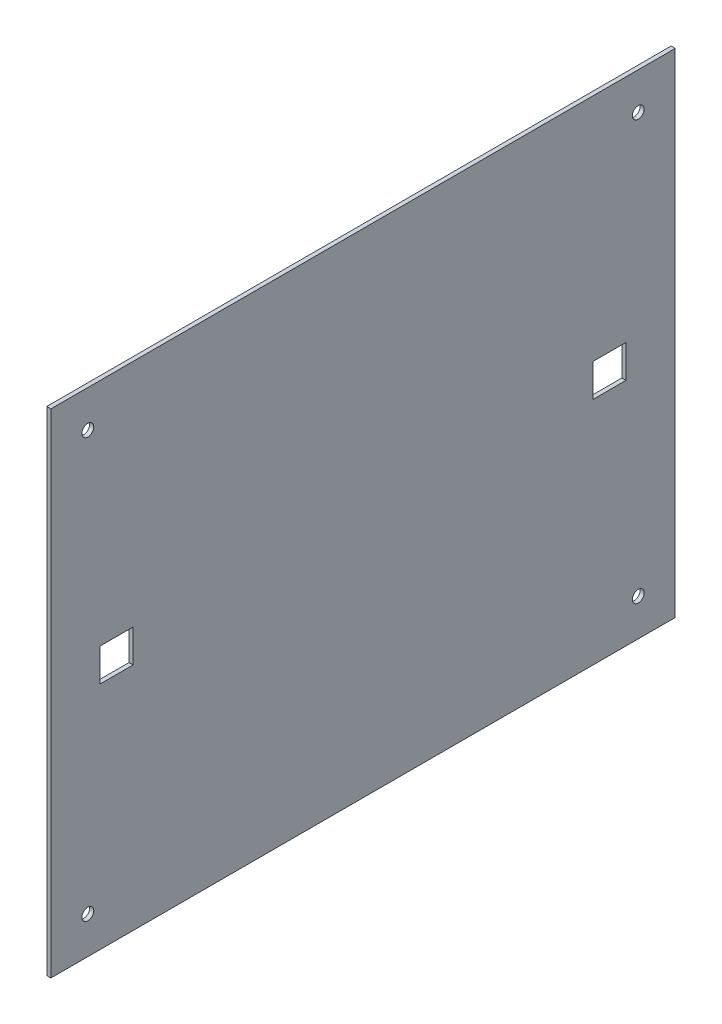
ISO-10303-21;
HEADER;
FILE_DESCRIPTION(('STEP AP214'),'2;1');
FILE_NAME('part.step','',(''),(''),'','','');
FILE_SCHEMA(('AUTOMOTIVE_DESIGN { 1 0 10303 214 1 1 1 1 }'));
ENDSEC;
DATA;
#1=APPLICATION_CONTEXT('core data for automotive mechanical design processes');
#2=APPLICATION_PROTOCOL_DEFINITION('international standard','automotive_design',2000,#1);
#3=PRODUCT_CONTEXT('',#1,'mechanical');
#4=PRODUCT('Part','Part','',(#3));
#5=PRODUCT_RELATED_PRODUCT_CATEGORY('part','',(#4));
#6=PRODUCT_DEFINITION_FORMATION('','',#4);
#7=PRODUCT_DEFINITION_CONTEXT('part definition',#1,'design');
#8=PRODUCT_DEFINITION('design','',#6,#7);
#9=PRODUCT_DEFINITION_SHAPE('','',#8);
#10=(LENGTH_UNIT() NAMED_UNIT(*) SI_UNIT(.MILLI.,.METRE.));
#11=(NAMED_UNIT(*) PLANE_ANGLE_UNIT() SI_UNIT($,.RADIAN.));
#12=(NAMED_UNIT(*) SI_UNIT($,.STERADIAN.) SOLID_ANGLE_UNIT());
#13=UNCERTAINTY_MEASURE_WITH_UNIT(LENGTH_MEASURE(1.E-05),#10,'distance_accuracy_value','');
#14=(GEOMETRIC_REPRESENTATION_CONTEXT(3) GLOBAL_UNCERTAINTY_ASSIGNED_CONTEXT((#13)) GLOBAL_UNIT_ASSIGNED_CONTEXT((#10,
#11,#12)) REPRESENTATION_CONTEXT('',''));
#15=CARTESIAN_POINT('',(0.,0.,0.));
#16=DIRECTION('',(0.,0.,1.));
#17=DIRECTION('',(1.,0.,0.));
#18=AXIS2_PLACEMENT_3D('',#15,#16,#17);
#19=CARTESIAN_POINT('',(1.5875,0.,0.));
#20=DIRECTION('',(0.,0.,-1.));
#21=DIRECTION('',(-1.,0.,0.));
#22=AXIS2_PLACEMENT_3D('',#19,#20,#21);
#23=PLANE('',#22);
#24=DIRECTION('',(0.,-1.,0.));
#25=VECTOR('',#24,1.);
#26=CARTESIAN_POINT('',(0.,0.,0.));
#27=LINE('',#26,#25);
#28=CARTESIAN_POINT('',(0.,190.5,0.));
#29=VERTEX_POINT('',#28);
#30=CARTESIAN_POINT('',(0.,0.,0.));
#31=VERTEX_POINT('',#30);
#32=EDGE_CURVE('E218',#29,#31,#27,.T.);
#33=ORIENTED_EDGE('',*,*,#32,.T.);
#34=DIRECTION('',(-1.,0.,0.));
#35=VECTOR('',#34,1.);
#36=CARTESIAN_POINT('',(1.5875,0.,0.));
#37=LINE('',#36,#35);
#38=CARTESIAN_POINT('',(1.5875,0.,0.));
#39=VERTEX_POINT('',#38);
#40=EDGE_CURVE('E11',#39,#31,#37,.T.);
#41=ORIENTED_EDGE('',*,*,#40,.F.);
#42=DIRECTION('',(0.,-1.,0.));
#43=VECTOR('',#42,1.);
#44=CARTESIAN_POINT('',(1.5875,0.,0.));
#45=LINE('',#44,#43);
#46=CARTESIAN_POINT('',(1.5875,190.5,0.));
#47=VERTEX_POINT('',#46);
#48=EDGE_CURVE('E221',#47,#39,#45,.T.);
#49=ORIENTED_EDGE('',*,*,#48,.F.);
#50=DIRECTION('',(-1.,0.,0.));
#51=VECTOR('',#50,1.);
#52=CARTESIAN_POINT('',(1.5875,190.5,0.));
#53=LINE('',#52,#51);
#54=EDGE_CURVE('E231',#47,#29,#53,.T.);
#55=ORIENTED_EDGE('',*,*,#54,.T.);
#56=EDGE_LOOP('',(#33,#41,#49,#55));
#57=FACE_BOUND('',#56,.T.);
#58=ADVANCED_FACE('F39',(#57),#23,.F.);
#59=CARTESIAN_POINT('',(1.5875,0.,0.));
#60=DIRECTION('',(0.,1.,0.));
#61=DIRECTION('',(0.,0.,1.));
#62=AXIS2_PLACEMENT_3D('',#59,#60,#61);
#63=PLANE('',#62);
#64=DIRECTION('',(0.,0.,-1.));
#65=VECTOR('',#64,1.);
#66=CARTESIAN_POINT('',(0.,0.,0.));
#67=LINE('',#66,#65);
#68=CARTESIAN_POINT('',(0.,0.,-241.3));
#69=VERTEX_POINT('',#68);
#70=EDGE_CURVE('E234',#31,#69,#67,.T.);
#71=ORIENTED_EDGE('',*,*,#70,.T.);
#72=DIRECTION('',(-1.,0.,0.));
#73=VECTOR('',#72,1.);
#74=CARTESIAN_POINT('',(1.5875,0.,-241.3));
#75=LINE('',#74,#73);
#76=CARTESIAN_POINT('',(1.5875,0.,-241.3));
#77=VERTEX_POINT('',#76);
#78=EDGE_CURVE('E46',#77,#69,#75,.T.);
#79=ORIENTED_EDGE('',*,*,#78,.F.);
#80=DIRECTION('',(0.,0.,-1.));
#81=VECTOR('',#80,1.);
#82=CARTESIAN_POINT('',(1.5875,0.,0.));
#83=LINE('',#82,#81);
#84=EDGE_CURVE('E224',#39,#77,#83,.T.);
#85=ORIENTED_EDGE('',*,*,#84,.F.);
#86=ORIENTED_EDGE('',*,*,#40,.T.);
#87=EDGE_LOOP('',(#71,#79,#85,#86));
#88=FACE_BOUND('',#87,.T.);
#89=ADVANCED_FACE('F263',(#88),#63,.F.);
#90=CARTESIAN_POINT('',(1.5875,0.,-241.3));
#91=DIRECTION('',(0.,0.,1.));
#92=DIRECTION('',(1.,0.,0.));
#93=AXIS2_PLACEMENT_3D('',#90,#91,#92);
#94=PLANE('',#93);
#95=DIRECTION('',(0.,1.,0.));
#96=VECTOR('',#95,1.);
#97=CARTESIAN_POINT('',(0.,0.,-241.3));
#98=LINE('',#97,#96);
#99=CARTESIAN_POINT('',(0.,190.5,-241.3));
#100=VERTEX_POINT('',#99);
#101=EDGE_CURVE('E236',#69,#100,#98,.T.);
#102=ORIENTED_EDGE('',*,*,#101,.T.);
#103=DIRECTION('',(-1.,0.,0.));
#104=VECTOR('',#103,1.);
#105=CARTESIAN_POINT('',(1.5875,190.5,-241.3));
#106=LINE('',#105,#104);
#107=CARTESIAN_POINT('',(1.5875,190.5,-241.3));
#108=VERTEX_POINT('',#107);
#109=EDGE_CURVE('E241',#108,#100,#106,.T.);
#110=ORIENTED_EDGE('',*,*,#109,.F.);
#111=DIRECTION('',(0.,1.,0.));
#112=VECTOR('',#111,1.);
#113=CARTESIAN_POINT('',(1.5875,0.,-241.3));
#114=LINE('',#113,#112);
#115=EDGE_CURVE('E227',#77,#108,#114,.T.);
#116=ORIENTED_EDGE('',*,*,#115,.F.);
#117=ORIENTED_EDGE('',*,*,#78,.T.);
#118=EDGE_LOOP('',(#102,#110,#116,#117));
#119=FACE_BOUND('',#118,.T.);
#120=ADVANCED_FACE('F248',(#119),#94,.F.);
#121=CARTESIAN_POINT('',(1.5875,190.5,0.));
#122=DIRECTION('',(0.,-1.,0.));
#123=DIRECTION('',(0.,0.,-1.));
#124=AXIS2_PLACEMENT_3D('',#121,#122,#123);
#125=PLANE('',#124);
#126=DIRECTION('',(0.,0.,1.));
#127=VECTOR('',#126,1.);
#128=CARTESIAN_POINT('',(0.,190.5,0.));
#129=LINE('',#128,#127);
#130=EDGE_CURVE('E225',#100,#29,#129,.T.);
#131=ORIENTED_EDGE('',*,*,#130,.T.);
#132=ORIENTED_EDGE('',*,*,#54,.F.);
#133=DIRECTION('',(0.,0.,1.));
#134=VECTOR('',#133,1.);
#135=CARTESIAN_POINT('',(1.5875,190.5,0.));
#136=LINE('',#135,#134);
#137=EDGE_CURVE('E229',#108,#47,#136,.T.);
#138=ORIENTED_EDGE('',*,*,#137,.F.);
#139=ORIENTED_EDGE('',*,*,#109,.T.);
#140=EDGE_LOOP('',(#131,#132,#138,#139));
#141=FACE_BOUND('',#140,.T.);
#142=ADVANCED_FACE('F256',(#141),#125,.F.);
#143=CARTESIAN_POINT('',(1.5875,0.,0.));
#144=DIRECTION('',(-1.,0.,0.));
#145=DIRECTION('',(0.,0.,1.));
#146=AXIS2_PLACEMENT_3D('',#143,#144,#145);
#147=PLANE('',#146);
#148=DIRECTION('',(0.,0.,-1.));
#149=VECTOR('',#148,1.);
#150=CARTESIAN_POINT('',(1.5875,88.9,-19.05));
#151=LINE('',#150,#149);
#152=CARTESIAN_POINT('',(1.5875,88.9,-19.05));
#153=VERTEX_POINT('',#152);
#154=CARTESIAN_POINT('',(1.5875,88.9,-31.75));
#155=VERTEX_POINT('',#154);
#156=EDGE_CURVE('E157',#153,#155,#151,.T.);
#157=ORIENTED_EDGE('',*,*,#156,.F.);
#158=DIRECTION('',(0.,-1.,0.));
#159=VECTOR('',#158,1.);
#160=CARTESIAN_POINT('',(1.5875,101.6,-19.05));
#161=LINE('',#160,#159);
#162=CARTESIAN_POINT('',(1.5875,101.6,-19.05));
#163=VERTEX_POINT('',#162);
#164=EDGE_CURVE('E53',#163,#153,#161,.T.);
#165=ORIENTED_EDGE('',*,*,#164,.F.);
#166=DIRECTION('',(0.,0.,1.));
#167=VECTOR('',#166,1.);
#168=CARTESIAN_POINT('',(1.5875,101.6,-19.05));
#169=LINE('',#168,#167);
#170=CARTESIAN_POINT('',(1.5875,101.6,-31.75));
#171=VERTEX_POINT('',#170);
#172=EDGE_CURVE('E148',#171,#163,#169,.T.);
#173=ORIENTED_EDGE('',*,*,#172,.F.);
#174=DIRECTION('',(0.,1.,0.));
#175=VECTOR('',#174,1.);
#176=CARTESIAN_POINT('',(1.5875,101.6,-31.75));
#177=LINE('',#176,#175);
#178=EDGE_CURVE('E151',#155,#171,#177,.T.);
#179=ORIENTED_EDGE('',*,*,#178,.F.);
#180=EDGE_LOOP('',(#157,#165,#173,#179));
#181=FACE_BOUND('',#180,.T.);
#182=DIRECTION('',(0.,0.,-1.));
#183=VECTOR('',#182,1.);
#184=CARTESIAN_POINT('',(1.5875,88.9,-209.55));
#185=LINE('',#184,#183);
#186=CARTESIAN_POINT('',(1.5875,88.9,-209.55));
#187=VERTEX_POINT('',#186);
#188=CARTESIAN_POINT('',(1.5875,88.9,-222.25));
#189=VERTEX_POINT('',#188);
#190=EDGE_CURVE('E183',#187,#189,#185,.T.);
#191=ORIENTED_EDGE('',*,*,#190,.F.);
#192=DIRECTION('',(0.,-1.,0.));
#193=VECTOR('',#192,1.);
#194=CARTESIAN_POINT('',(1.5875,101.6,-209.55));
#195=LINE('',#194,#193);
#196=CARTESIAN_POINT('',(1.5875,101.6,-209.55));
#197=VERTEX_POINT('',#196);
#198=EDGE_CURVE('E61',#197,#187,#195,.T.);
#199=ORIENTED_EDGE('',*,*,#198,.F.);
#200=DIRECTION('',(0.,0.,1.));
#201=VECTOR('',#200,1.);
#202=CARTESIAN_POINT('',(1.5875,101.6,-209.55));
#203=LINE('',#202,#201);
#204=CARTESIAN_POINT('',(1.5875,101.6,-222.25));
#205=VERTEX_POINT('',#204);
#206=EDGE_CURVE('E172',#205,#197,#203,.T.);
#207=ORIENTED_EDGE('',*,*,#206,.F.);
#208=DIRECTION('',(0.,1.,0.));
#209=VECTOR('',#208,1.);
#210=CARTESIAN_POINT('',(1.5875,101.6,-222.25));
#211=LINE('',#210,#209);
#212=EDGE_CURVE('E186',#189,#205,#211,.T.);
#213=ORIENTED_EDGE('',*,*,#212,.F.);
#214=EDGE_LOOP('',(#191,#199,#207,#213));
#215=FACE_BOUND('',#214,.T.);
#216=CARTESIAN_POINT('',(1.5875,176.2125,-227.0125));
#217=DIRECTION('',(1.,0.,0.));
#218=DIRECTION('',(0.,0.,1.));
#219=AXIS2_PLACEMENT_3D('',#216,#217,#218);
#220=CIRCLE('',#219,2.28600000000001);
#221=CARTESIAN_POINT('',(1.5875,176.2125,-224.7265));
#222=VERTEX_POINT('',#221);
#223=EDGE_CURVE('E207',#222,#222,#220,.T.);
#224=ORIENTED_EDGE('',*,*,#223,.F.);
#225=EDGE_LOOP('',(#224));
#226=FACE_BOUND('',#225,.T.);
#227=CARTESIAN_POINT('',(1.5875,14.2875,-14.2875));
#228=DIRECTION('',(1.,0.,0.));
#229=DIRECTION('',(0.,0.,1.));
#230=AXIS2_PLACEMENT_3D('',#227,#228,#229);
#231=CIRCLE('',#230,2.28600000000001);
#232=CARTESIAN_POINT('',(1.5875,14.2875,-12.0015));
#233=VERTEX_POINT('',#232);
#234=EDGE_CURVE('E200',#233,#233,#231,.T.);
#235=ORIENTED_EDGE('',*,*,#234,.F.);
#236=EDGE_LOOP('',(#235));
#237=FACE_BOUND('',#236,.T.);
#238=CARTESIAN_POINT('',(1.5875,176.2125,-14.2875));
#239=DIRECTION('',(1.,0.,0.));
#240=DIRECTION('',(0.,0.,-1.));
#241=AXIS2_PLACEMENT_3D('',#238,#239,#240);
#242=CIRCLE('',#241,2.28600000000001);
#243=CARTESIAN_POINT('',(1.5875,176.2125,-16.5735));
#244=VERTEX_POINT('',#243);
#245=EDGE_CURVE('E164',#244,#244,#242,.T.);
#246=ORIENTED_EDGE('',*,*,#245,.F.);
#247=EDGE_LOOP('',(#246));
#248=FACE_BOUND('',#247,.T.);
#249=CARTESIAN_POINT('',(1.5875,14.2875,-227.0125));
#250=DIRECTION('',(1.,0.,0.));
#251=DIRECTION('',(0.,0.,-1.));
#252=AXIS2_PLACEMENT_3D('',#249,#250,#251);
#253=CIRCLE('',#252,2.28600000000001);
#254=CARTESIAN_POINT('',(1.5875,14.2875,-229.2985));
#255=VERTEX_POINT('',#254);
#256=EDGE_CURVE('E206',#255,#255,#253,.T.);
#257=ORIENTED_EDGE('',*,*,#256,.F.);
#258=EDGE_LOOP('',(#257));
#259=FACE_BOUND('',#258,.T.);
#260=ORIENTED_EDGE('',*,*,#48,.T.);
#261=ORIENTED_EDGE('',*,*,#84,.T.);
#262=ORIENTED_EDGE('',*,*,#115,.T.);
#263=ORIENTED_EDGE('',*,*,#137,.T.);
#264=EDGE_LOOP('',(#260,#261,#262,#263));
#265=FACE_BOUND('',#264,.T.);
#266=ADVANCED_FACE('F262',(#181,#215,#226,#237,#248,#259,#265),#147,.F.);
#267=CARTESIAN_POINT('',(0.,0.,0.));
#268=DIRECTION('',(-1.,0.,0.));
#269=DIRECTION('',(0.,0.,1.));
#270=AXIS2_PLACEMENT_3D('',#267,#268,#269);
#271=PLANE('',#270);
#272=DIRECTION('',(0.,-1.,0.));
#273=VECTOR('',#272,1.);
#274=CARTESIAN_POINT('',(0.,101.6,-19.05));
#275=LINE('',#274,#273);
#276=CARTESIAN_POINT('',(0.,101.6,-19.05));
#277=VERTEX_POINT('',#276);
#278=CARTESIAN_POINT('',(0.,88.9,-19.05));
#279=VERTEX_POINT('',#278);
#280=EDGE_CURVE('E129',#277,#279,#275,.T.);
#281=ORIENTED_EDGE('',*,*,#280,.T.);
#282=DIRECTION('',(0.,0.,-1.));
#283=VECTOR('',#282,1.);
#284=CARTESIAN_POINT('',(0.,88.9,-19.05));
#285=LINE('',#284,#283);
#286=CARTESIAN_POINT('',(0.,88.9,-31.75));
#287=VERTEX_POINT('',#286);
#288=EDGE_CURVE('E139',#279,#287,#285,.T.);
#289=ORIENTED_EDGE('',*,*,#288,.T.);
#290=DIRECTION('',(0.,1.,0.));
#291=VECTOR('',#290,1.);
#292=CARTESIAN_POINT('',(0.,101.6,-31.75));
#293=LINE('',#292,#291);
#294=CARTESIAN_POINT('',(0.,101.6,-31.75));
#295=VERTEX_POINT('',#294);
#296=EDGE_CURVE('E143',#287,#295,#293,.T.);
#297=ORIENTED_EDGE('',*,*,#296,.T.);
#298=DIRECTION('',(0.,0.,1.));
#299=VECTOR('',#298,1.);
#300=CARTESIAN_POINT('',(0.,101.6,-19.05));
#301=LINE('',#300,#299);
#302=EDGE_CURVE('E135',#295,#277,#301,.T.);
#303=ORIENTED_EDGE('',*,*,#302,.T.);
#304=EDGE_LOOP('',(#281,#289,#297,#303));
#305=FACE_BOUND('',#304,.T.);
#306=DIRECTION('',(0.,-1.,0.));
#307=VECTOR('',#306,1.);
#308=CARTESIAN_POINT('',(0.,101.6,-209.55));
#309=LINE('',#308,#307);
#310=CARTESIAN_POINT('',(0.,101.6,-209.55));
#311=VERTEX_POINT('',#310);
#312=CARTESIAN_POINT('',(0.,88.9,-209.55));
#313=VERTEX_POINT('',#312);
#314=EDGE_CURVE('E168',#311,#313,#309,.T.);
#315=ORIENTED_EDGE('',*,*,#314,.T.);
#316=DIRECTION('',(0.,0.,-1.));
#317=VECTOR('',#316,1.);
#318=CARTESIAN_POINT('',(0.,88.9,-209.55));
#319=LINE('',#318,#317);
#320=CARTESIAN_POINT('',(0.,88.9,-222.25));
#321=VERTEX_POINT('',#320);
#322=EDGE_CURVE('E171',#313,#321,#319,.T.);
#323=ORIENTED_EDGE('',*,*,#322,.T.);
#324=DIRECTION('',(0.,1.,0.));
#325=VECTOR('',#324,1.);
#326=CARTESIAN_POINT('',(0.,101.6,-222.25));
#327=LINE('',#326,#325);
#328=CARTESIAN_POINT('',(0.,101.6,-222.25));
#329=VERTEX_POINT('',#328);
#330=EDGE_CURVE('E175',#321,#329,#327,.T.);
#331=ORIENTED_EDGE('',*,*,#330,.T.);
#332=DIRECTION('',(0.,0.,1.));
#333=VECTOR('',#332,1.);
#334=CARTESIAN_POINT('',(0.,101.6,-209.55));
#335=LINE('',#334,#333);
#336=EDGE_CURVE('E178',#329,#311,#335,.T.);
#337=ORIENTED_EDGE('',*,*,#336,.T.);
#338=EDGE_LOOP('',(#315,#323,#331,#337));
#339=FACE_BOUND('',#338,.T.);
#340=CARTESIAN_POINT('',(0.,176.2125,-227.0125));
#341=DIRECTION('',(1.,0.,0.));
#342=DIRECTION('',(0.,0.,1.));
#343=AXIS2_PLACEMENT_3D('',#340,#341,#342);
#344=CIRCLE('',#343,2.28600000000001);
#345=CARTESIAN_POINT('',(0.,176.2125,-224.7265));
#346=VERTEX_POINT('',#345);
#347=EDGE_CURVE('E203',#346,#346,#344,.T.);
#348=ORIENTED_EDGE('',*,*,#347,.T.);
#349=EDGE_LOOP('',(#348));
#350=FACE_BOUND('',#349,.T.);
#351=CARTESIAN_POINT('',(0.,14.2875,-14.2875));
#352=DIRECTION('',(1.,0.,0.));
#353=DIRECTION('',(0.,0.,1.));
#354=AXIS2_PLACEMENT_3D('',#351,#352,#353);
#355=CIRCLE('',#354,2.28600000000001);
#356=CARTESIAN_POINT('',(0.,14.2875,-12.0015));
#357=VERTEX_POINT('',#356);
#358=EDGE_CURVE('E210',#357,#357,#355,.T.);
#359=ORIENTED_EDGE('',*,*,#358,.T.);
#360=EDGE_LOOP('',(#359));
#361=FACE_BOUND('',#360,.T.);
#362=CARTESIAN_POINT('',(0.,176.2125,-14.2875));
#363=DIRECTION('',(1.,0.,0.));
#364=DIRECTION('',(0.,0.,-1.));
#365=AXIS2_PLACEMENT_3D('',#362,#363,#364);
#366=CIRCLE('',#365,2.28600000000001);
#367=CARTESIAN_POINT('',(0.,176.2125,-16.5735));
#368=VERTEX_POINT('',#367);
#369=EDGE_CURVE('E197',#368,#368,#366,.T.);
#370=ORIENTED_EDGE('',*,*,#369,.T.);
#371=EDGE_LOOP('',(#370));
#372=FACE_BOUND('',#371,.T.);
#373=CARTESIAN_POINT('',(0.,14.2875,-227.0125));
#374=DIRECTION('',(1.,0.,0.));
#375=DIRECTION('',(0.,0.,-1.));
#376=AXIS2_PLACEMENT_3D('',#373,#374,#375);
#377=CIRCLE('',#376,2.28600000000001);
#378=CARTESIAN_POINT('',(0.,14.2875,-229.2985));
#379=VERTEX_POINT('',#378);
#380=EDGE_CURVE('E215',#379,#379,#377,.T.);
#381=ORIENTED_EDGE('',*,*,#380,.T.);
#382=EDGE_LOOP('',(#381));
#383=FACE_BOUND('',#382,.T.);
#384=ORIENTED_EDGE('',*,*,#32,.F.);
#385=ORIENTED_EDGE('',*,*,#130,.F.);
#386=ORIENTED_EDGE('',*,*,#101,.F.);
#387=ORIENTED_EDGE('',*,*,#70,.F.);
#388=EDGE_LOOP('',(#384,#385,#386,#387));
#389=FACE_BOUND('',#388,.T.);
#390=ADVANCED_FACE('F145',(#305,#339,#350,#361,#372,#383,#389),#271,.T.);
#391=CARTESIAN_POINT('',(0.,14.2875,-227.0125));
#392=DIRECTION('',(1.,0.,0.));
#393=DIRECTION('',(0.,0.,-1.));
#394=AXIS2_PLACEMENT_3D('',#391,#392,#393);
#395=CYLINDRICAL_SURFACE('',#394,2.28600000000001);
#396=ORIENTED_EDGE('',*,*,#380,.F.);
#397=EDGE_LOOP('',(#396));
#398=FACE_BOUND('',#397,.T.);
#399=ORIENTED_EDGE('',*,*,#256,.T.);
#400=EDGE_LOOP('',(#399));
#401=FACE_BOUND('',#400,.T.);
#402=ADVANCED_FACE('F275',(#398,#401),#395,.F.);
#403=CARTESIAN_POINT('',(0.,176.2125,-14.2875));
#404=DIRECTION('',(1.,0.,0.));
#405=DIRECTION('',(0.,0.,-1.));
#406=AXIS2_PLACEMENT_3D('',#403,#404,#405);
#407=CYLINDRICAL_SURFACE('',#406,2.28600000000001);
#408=ORIENTED_EDGE('',*,*,#369,.F.);
#409=EDGE_LOOP('',(#408));
#410=FACE_BOUND('',#409,.T.);
#411=ORIENTED_EDGE('',*,*,#245,.T.);
#412=EDGE_LOOP('',(#411));
#413=FACE_BOUND('',#412,.T.);
#414=ADVANCED_FACE('F281',(#410,#413),#407,.F.);
#415=CARTESIAN_POINT('',(0.,14.2875,-14.2875));
#416=DIRECTION('',(1.,0.,0.));
#417=DIRECTION('',(0.,0.,-1.));
#418=AXIS2_PLACEMENT_3D('',#415,#416,#417);
#419=CYLINDRICAL_SURFACE('',#418,2.28600000000001);
#420=ORIENTED_EDGE('',*,*,#358,.F.);
#421=EDGE_LOOP('',(#420));
#422=FACE_BOUND('',#421,.T.);
#423=ORIENTED_EDGE('',*,*,#234,.T.);
#424=EDGE_LOOP('',(#423));
#425=FACE_BOUND('',#424,.T.);
#426=ADVANCED_FACE('F283',(#422,#425),#419,.F.);
#427=CARTESIAN_POINT('',(0.,176.2125,-227.0125));
#428=DIRECTION('',(1.,0.,0.));
#429=DIRECTION('',(0.,0.,-1.));
#430=AXIS2_PLACEMENT_3D('',#427,#428,#429);
#431=CYLINDRICAL_SURFACE('',#430,2.28600000000001);
#432=ORIENTED_EDGE('',*,*,#347,.F.);
#433=EDGE_LOOP('',(#432));
#434=FACE_BOUND('',#433,.T.);
#435=ORIENTED_EDGE('',*,*,#223,.T.);
#436=EDGE_LOOP('',(#435));
#437=FACE_BOUND('',#436,.T.);
#438=ADVANCED_FACE('F286',(#434,#437),#431,.F.);
#439=CARTESIAN_POINT('',(0.,101.6,-209.55));
#440=DIRECTION('',(0.,0.,1.));
#441=DIRECTION('',(1.,0.,0.));
#442=AXIS2_PLACEMENT_3D('',#439,#440,#441);
#443=PLANE('',#442);
#444=ORIENTED_EDGE('',*,*,#198,.T.);
#445=DIRECTION('',(1.,0.,0.));
#446=VECTOR('',#445,1.);
#447=CARTESIAN_POINT('',(0.,88.9,-209.55));
#448=LINE('',#447,#446);
#449=EDGE_CURVE('E181',#313,#187,#448,.T.);
#450=ORIENTED_EDGE('',*,*,#449,.F.);
#451=ORIENTED_EDGE('',*,*,#314,.F.);
#452=DIRECTION('',(1.,0.,0.));
#453=VECTOR('',#452,1.);
#454=CARTESIAN_POINT('',(0.,101.6,-209.55));
#455=LINE('',#454,#453);
#456=EDGE_CURVE('E158',#311,#197,#455,.T.);
#457=ORIENTED_EDGE('',*,*,#456,.T.);
#458=EDGE_LOOP('',(#444,#450,#451,#457));
#459=FACE_BOUND('',#458,.T.);
#460=ADVANCED_FACE('F290',(#459),#443,.F.);
#461=CARTESIAN_POINT('',(0.,101.6,-209.55));
#462=DIRECTION('',(0.,1.,0.));
#463=DIRECTION('',(0.,0.,1.));
#464=AXIS2_PLACEMENT_3D('',#461,#462,#463);
#465=PLANE('',#464);
#466=ORIENTED_EDGE('',*,*,#206,.T.);
#467=ORIENTED_EDGE('',*,*,#456,.F.);
#468=ORIENTED_EDGE('',*,*,#336,.F.);
#469=DIRECTION('',(1.,0.,0.));
#470=VECTOR('',#469,1.);
#471=CARTESIAN_POINT('',(0.,101.6,-222.25));
#472=LINE('',#471,#470);
#473=EDGE_CURVE('E192',#329,#205,#472,.T.);
#474=ORIENTED_EDGE('',*,*,#473,.T.);
#475=EDGE_LOOP('',(#466,#467,#468,#474));
#476=FACE_BOUND('',#475,.T.);
#477=ADVANCED_FACE('F297',(#476),#465,.F.);
#478=CARTESIAN_POINT('',(0.,101.6,-222.25));
#479=DIRECTION('',(0.,0.,-1.));
#480=DIRECTION('',(-1.,0.,0.));
#481=AXIS2_PLACEMENT_3D('',#478,#479,#480);
#482=PLANE('',#481);
#483=ORIENTED_EDGE('',*,*,#212,.T.);
#484=ORIENTED_EDGE('',*,*,#473,.F.);
#485=ORIENTED_EDGE('',*,*,#330,.F.);
#486=DIRECTION('',(1.,0.,0.));
#487=VECTOR('',#486,1.);
#488=CARTESIAN_POINT('',(0.,88.9,-222.25));
#489=LINE('',#488,#487);
#490=EDGE_CURVE('E194',#321,#189,#489,.T.);
#491=ORIENTED_EDGE('',*,*,#490,.T.);
#492=EDGE_LOOP('',(#483,#484,#485,#491));
#493=FACE_BOUND('',#492,.T.);
#494=ADVANCED_FACE('F301',(#493),#482,.F.);
#495=CARTESIAN_POINT('',(0.,88.9,-209.55));
#496=DIRECTION('',(0.,-1.,0.));
#497=DIRECTION('',(0.,0.,-1.));
#498=AXIS2_PLACEMENT_3D('',#495,#496,#497);
#499=PLANE('',#498);
#500=ORIENTED_EDGE('',*,*,#190,.T.);
#501=ORIENTED_EDGE('',*,*,#490,.F.);
#502=ORIENTED_EDGE('',*,*,#322,.F.);
#503=ORIENTED_EDGE('',*,*,#449,.T.);
#504=EDGE_LOOP('',(#500,#501,#502,#503));
#505=FACE_BOUND('',#504,.T.);
#506=ADVANCED_FACE('F298',(#505),#499,.F.);
#507=CARTESIAN_POINT('',(0.,101.6,-19.05));
#508=DIRECTION('',(0.,0.,1.));
#509=DIRECTION('',(1.,0.,0.));
#510=AXIS2_PLACEMENT_3D('',#507,#508,#509);
#511=PLANE('',#510);
#512=ORIENTED_EDGE('',*,*,#164,.T.);
#513=DIRECTION('',(1.,0.,0.));
#514=VECTOR('',#513,1.);
#515=CARTESIAN_POINT('',(0.,88.9,-19.05));
#516=LINE('',#515,#514);
#517=EDGE_CURVE('E125',#279,#153,#516,.T.);
#518=ORIENTED_EDGE('',*,*,#517,.F.);
#519=ORIENTED_EDGE('',*,*,#280,.F.);
#520=DIRECTION('',(1.,0.,0.));
#521=VECTOR('',#520,1.);
#522=CARTESIAN_POINT('',(0.,101.6,-19.05));
#523=LINE('',#522,#521);
#524=EDGE_CURVE('E162',#277,#163,#523,.T.);
#525=ORIENTED_EDGE('',*,*,#524,.T.);
#526=EDGE_LOOP('',(#512,#518,#519,#525));
#527=FACE_BOUND('',#526,.T.);
#528=ADVANCED_FACE('F127',(#527),#511,.F.);
#529=CARTESIAN_POINT('',(0.,101.6,-19.05));
#530=DIRECTION('',(0.,1.,0.));
#531=DIRECTION('',(0.,0.,1.));
#532=AXIS2_PLACEMENT_3D('',#529,#530,#531);
#533=PLANE('',#532);
#534=ORIENTED_EDGE('',*,*,#172,.T.);
#535=ORIENTED_EDGE('',*,*,#524,.F.);
#536=ORIENTED_EDGE('',*,*,#302,.F.);
#537=DIRECTION('',(1.,0.,0.));
#538=VECTOR('',#537,1.);
#539=CARTESIAN_POINT('',(0.,101.6,-31.75));
#540=LINE('',#539,#538);
#541=EDGE_CURVE('E165',#295,#171,#540,.T.);
#542=ORIENTED_EDGE('',*,*,#541,.T.);
#543=EDGE_LOOP('',(#534,#535,#536,#542));
#544=FACE_BOUND('',#543,.T.);
#545=ADVANCED_FACE('F311',(#544),#533,.F.);
#546=CARTESIAN_POINT('',(0.,101.6,-31.75));
#547=DIRECTION('',(0.,0.,-1.));
#548=DIRECTION('',(-1.,0.,0.));
#549=AXIS2_PLACEMENT_3D('',#546,#547,#548);
#550=PLANE('',#549);
#551=ORIENTED_EDGE('',*,*,#178,.T.);
#552=ORIENTED_EDGE('',*,*,#541,.F.);
#553=ORIENTED_EDGE('',*,*,#296,.F.);
#554=DIRECTION('',(1.,0.,0.));
#555=VECTOR('',#554,1.);
#556=CARTESIAN_POINT('',(0.,88.9,-31.75));
#557=LINE('',#556,#555);
#558=EDGE_CURVE('E134',#287,#155,#557,.T.);
#559=ORIENTED_EDGE('',*,*,#558,.T.);
#560=EDGE_LOOP('',(#551,#552,#553,#559));
#561=FACE_BOUND('',#560,.T.);
#562=ADVANCED_FACE('F314',(#561),#550,.F.);
#563=CARTESIAN_POINT('',(0.,88.9,-19.05));
#564=DIRECTION('',(0.,-1.,0.));
#565=DIRECTION('',(0.,0.,-1.));
#566=AXIS2_PLACEMENT_3D('',#563,#564,#565);
#567=PLANE('',#566);
#568=ORIENTED_EDGE('',*,*,#156,.T.);
#569=ORIENTED_EDGE('',*,*,#558,.F.);
#570=ORIENTED_EDGE('',*,*,#288,.F.);
#571=ORIENTED_EDGE('',*,*,#517,.T.);
#572=EDGE_LOOP('',(#568,#569,#570,#571));
#573=FACE_BOUND('',#572,.T.);
#574=ADVANCED_FACE('F140',(#573),#567,.F.);
#575=CLOSED_SHELL('',(#58,#89,#120,#142,#266,#390,#402,#414,#426,#438,#460,#477,#494,#506,#528,
#545,#562,#574));
#576=MANIFOLD_SOLID_BREP('B2',#575);
#577=ADVANCED_BREP_SHAPE_REPRESENTATION('',(#18,#576),#14);
#578=SHAPE_DEFINITION_REPRESENTATION(#9,#577);
ENDSEC;
END-ISO-10303-21;
